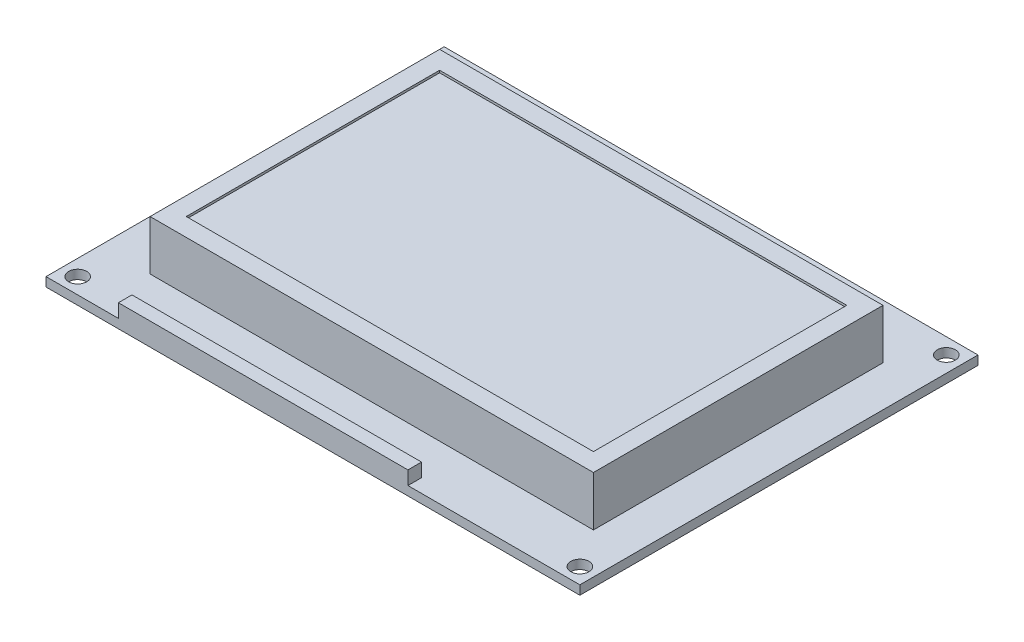
ISO-10303-21;
HEADER;
FILE_DESCRIPTION(('STEP AP214'),'2;1');
FILE_NAME('part.step','',(''),(''),'','','');
FILE_SCHEMA(('AUTOMOTIVE_DESIGN { 1 0 10303 214 1 1 1 1 }'));
ENDSEC;
DATA;
#1=APPLICATION_CONTEXT('core data for automotive mechanical design processes');
#2=APPLICATION_PROTOCOL_DEFINITION('international standard','automotive_design',2000,#1);
#3=PRODUCT_CONTEXT('',#1,'mechanical');
#4=PRODUCT('Part','Part','',(#3));
#5=PRODUCT_RELATED_PRODUCT_CATEGORY('part','',(#4));
#6=PRODUCT_DEFINITION_FORMATION('','',#4);
#7=PRODUCT_DEFINITION_CONTEXT('part definition',#1,'design');
#8=PRODUCT_DEFINITION('design','',#6,#7);
#9=PRODUCT_DEFINITION_SHAPE('','',#8);
#10=(LENGTH_UNIT() NAMED_UNIT(*) SI_UNIT(.MILLI.,.METRE.));
#11=(NAMED_UNIT(*) PLANE_ANGLE_UNIT() SI_UNIT($,.RADIAN.));
#12=(NAMED_UNIT(*) SI_UNIT($,.STERADIAN.) SOLID_ANGLE_UNIT());
#13=UNCERTAINTY_MEASURE_WITH_UNIT(LENGTH_MEASURE(1.E-05),#10,'distance_accuracy_value','');
#14=(GEOMETRIC_REPRESENTATION_CONTEXT(3) GLOBAL_UNCERTAINTY_ASSIGNED_CONTEXT((#13)) GLOBAL_UNIT_ASSIGNED_CONTEXT((#10,
#11,#12)) REPRESENTATION_CONTEXT('',''));
#15=CARTESIAN_POINT('',(0.,0.,0.));
#16=DIRECTION('',(0.,0.,1.));
#17=DIRECTION('',(1.,0.,0.));
#18=AXIS2_PLACEMENT_3D('',#15,#16,#17);
#19=CARTESIAN_POINT('',(0.,1.5875,0.));
#20=DIRECTION('',(0.,-1.,0.));
#21=DIRECTION('',(0.,0.,-1.));
#22=AXIS2_PLACEMENT_3D('',#19,#20,#21);
#23=PLANE('',#22);
#24=DIRECTION('',(0.,0.,1.));
#25=VECTOR('',#24,1.);
#26=CARTESIAN_POINT('',(8.73125,1.5875,-9.525));
#27=LINE('',#26,#25);
#28=CARTESIAN_POINT('',(8.73125,1.5875,-60.325));
#29=VERTEX_POINT('',#28);
#30=CARTESIAN_POINT('',(8.73125,1.5875,-9.525));
#31=VERTEX_POINT('',#30);
#32=EDGE_CURVE('E212',#29,#31,#27,.T.);
#33=ORIENTED_EDGE('',*,*,#32,.F.);
#34=DIRECTION('',(-1.,0.,0.));
#35=VECTOR('',#34,1.);
#36=CARTESIAN_POINT('',(8.73125,1.5875,-60.325));
#37=LINE('',#36,#35);
#38=CARTESIAN_POINT('',(86.51875,1.5875,-60.325));
#39=VERTEX_POINT('',#38);
#40=EDGE_CURVE('E217',#39,#29,#37,.T.);
#41=ORIENTED_EDGE('',*,*,#40,.F.);
#42=DIRECTION('',(0.,0.,-1.));
#43=VECTOR('',#42,1.);
#44=CARTESIAN_POINT('',(86.51875,1.5875,-9.525));
#45=LINE('',#44,#43);
#46=CARTESIAN_POINT('',(86.51875,1.5875,-9.525));
#47=VERTEX_POINT('',#46);
#48=EDGE_CURVE('E229',#47,#39,#45,.T.);
#49=ORIENTED_EDGE('',*,*,#48,.F.);
#50=DIRECTION('',(1.,0.,0.));
#51=VECTOR('',#50,1.);
#52=CARTESIAN_POINT('',(8.73125,1.5875,-9.525));
#53=LINE('',#52,#51);
#54=EDGE_CURVE('E226',#31,#47,#53,.T.);
#55=ORIENTED_EDGE('',*,*,#54,.F.);
#56=EDGE_LOOP('',(#33,#41,#49,#55));
#57=FACE_BOUND('',#56,.T.);
#58=CARTESIAN_POINT('',(2.77812499999999,1.5875,-67.071875));
#59=DIRECTION('',(0.,1.,0.));
#60=DIRECTION('',(0.,0.,1.));
#61=AXIS2_PLACEMENT_3D('',#58,#59,#60);
#62=CIRCLE('',#61,1.5875);
#63=CARTESIAN_POINT('',(2.77812499999999,1.5875,-65.484375));
#64=VERTEX_POINT('',#63);
#65=EDGE_CURVE('E264',#64,#64,#62,.T.);
#66=ORIENTED_EDGE('',*,*,#65,.F.);
#67=EDGE_LOOP('',(#66));
#68=FACE_BOUND('',#67,.T.);
#69=CARTESIAN_POINT('',(90.884375,1.5875,-67.071875));
#70=DIRECTION('',(0.,1.,0.));
#71=DIRECTION('',(0.,0.,1.));
#72=AXIS2_PLACEMENT_3D('',#69,#70,#71);
#73=CIRCLE('',#72,1.5875);
#74=CARTESIAN_POINT('',(90.884375,1.5875,-65.484375));
#75=VERTEX_POINT('',#74);
#76=EDGE_CURVE('E258',#75,#75,#73,.T.);
#77=ORIENTED_EDGE('',*,*,#76,.F.);
#78=EDGE_LOOP('',(#77));
#79=FACE_BOUND('',#78,.T.);
#80=CARTESIAN_POINT('',(2.778125,1.5875,-2.778125));
#81=DIRECTION('',(0.,1.,0.));
#82=DIRECTION('',(0.,0.,1.));
#83=AXIS2_PLACEMENT_3D('',#80,#81,#82);
#84=CIRCLE('',#83,1.5875);
#85=CARTESIAN_POINT('',(2.778125,1.5875,-1.190625));
#86=VERTEX_POINT('',#85);
#87=EDGE_CURVE('E252',#86,#86,#84,.T.);
#88=ORIENTED_EDGE('',*,*,#87,.F.);
#89=EDGE_LOOP('',(#88));
#90=FACE_BOUND('',#89,.T.);
#91=CARTESIAN_POINT('',(90.884375,1.5875,-2.778125));
#92=DIRECTION('',(0.,1.,0.));
#93=DIRECTION('',(0.,0.,1.));
#94=AXIS2_PLACEMENT_3D('',#91,#92,#93);
#95=CIRCLE('',#94,1.5875);
#96=CARTESIAN_POINT('',(90.884375,1.5875,-1.190625));
#97=VERTEX_POINT('',#96);
#98=EDGE_CURVE('E246',#97,#97,#95,.T.);
#99=ORIENTED_EDGE('',*,*,#98,.F.);
#100=EDGE_LOOP('',(#99));
#101=FACE_BOUND('',#100,.T.);
#102=DIRECTION('',(0.,0.,1.));
#103=VECTOR('',#102,1.);
#104=CARTESIAN_POINT('',(12.7,1.5875,0.));
#105=LINE('',#104,#103);
#106=CARTESIAN_POINT('',(12.7,1.5875,-2.38125));
#107=VERTEX_POINT('',#106);
#108=CARTESIAN_POINT('',(12.7,1.5875,0.));
#109=VERTEX_POINT('',#108);
#110=EDGE_CURVE('E57',#107,#109,#105,.T.);
#111=ORIENTED_EDGE('',*,*,#110,.F.);
#112=DIRECTION('',(-1.,0.,0.));
#113=VECTOR('',#112,1.);
#114=CARTESIAN_POINT('',(12.7,1.5875,-2.38125));
#115=LINE('',#114,#113);
#116=CARTESIAN_POINT('',(63.5,1.5875,-2.38125));
#117=VERTEX_POINT('',#116);
#118=EDGE_CURVE('E189',#117,#107,#115,.T.);
#119=ORIENTED_EDGE('',*,*,#118,.F.);
#120=DIRECTION('',(0.,0.,-1.));
#121=VECTOR('',#120,1.);
#122=CARTESIAN_POINT('',(63.5,1.5875,0.));
#123=LINE('',#122,#121);
#124=CARTESIAN_POINT('',(63.5,1.5875,0.));
#125=VERTEX_POINT('',#124);
#126=EDGE_CURVE('E197',#125,#117,#123,.T.);
#127=ORIENTED_EDGE('',*,*,#126,.F.);
#128=DIRECTION('',(1.,0.,0.));
#129=VECTOR('',#128,1.);
#130=CARTESIAN_POINT('',(0.,1.5875,0.));
#131=LINE('',#130,#129);
#132=CARTESIAN_POINT('',(93.6625,1.5875,0.));
#133=VERTEX_POINT('',#132);
#134=EDGE_CURVE('E273',#125,#133,#131,.T.);
#135=ORIENTED_EDGE('',*,*,#134,.T.);
#136=DIRECTION('',(0.,0.,-1.));
#137=VECTOR('',#136,1.);
#138=CARTESIAN_POINT('',(93.6625,1.5875,0.));
#139=LINE('',#138,#137);
#140=CARTESIAN_POINT('',(93.6625,1.5875,-69.85));
#141=VERTEX_POINT('',#140);
#142=EDGE_CURVE('E277',#133,#141,#139,.T.);
#143=ORIENTED_EDGE('',*,*,#142,.T.);
#144=DIRECTION('',(-1.,0.,0.));
#145=VECTOR('',#144,1.);
#146=CARTESIAN_POINT('',(0.,1.5875,-69.85));
#147=LINE('',#146,#145);
#148=CARTESIAN_POINT('',(0.,1.5875,-69.85));
#149=VERTEX_POINT('',#148);
#150=EDGE_CURVE('E279',#141,#149,#147,.T.);
#151=ORIENTED_EDGE('',*,*,#150,.T.);
#152=DIRECTION('',(0.,0.,1.));
#153=VECTOR('',#152,1.);
#154=CARTESIAN_POINT('',(0.,1.5875,0.));
#155=LINE('',#154,#153);
#156=CARTESIAN_POINT('',(0.,1.5875,0.));
#157=VERTEX_POINT('',#156);
#158=EDGE_CURVE('E270',#149,#157,#155,.T.);
#159=ORIENTED_EDGE('',*,*,#158,.T.);
#160=EDGE_CURVE('E275',#157,#109,#131,.T.);
#161=ORIENTED_EDGE('',*,*,#160,.T.);
#162=EDGE_LOOP('',(#111,#119,#127,#135,#143,#151,#159,#161));
#163=FACE_BOUND('',#162,.T.);
#164=ADVANCED_FACE('F34',(#57,#68,#79,#90,#101,#163),#23,.F.);
#165=CARTESIAN_POINT('',(0.,0.,0.));
#166=DIRECTION('',(0.,-1.,0.));
#167=DIRECTION('',(0.,0.,-1.));
#168=AXIS2_PLACEMENT_3D('',#165,#166,#167);
#169=PLANE('',#168);
#170=CARTESIAN_POINT('',(2.778125,0.,-2.778125));
#171=DIRECTION('',(0.,1.,0.));
#172=DIRECTION('',(0.,0.,1.));
#173=AXIS2_PLACEMENT_3D('',#170,#171,#172);
#174=CIRCLE('',#173,1.5875);
#175=CARTESIAN_POINT('',(2.778125,0.,-1.190625));
#176=VERTEX_POINT('',#175);
#177=EDGE_CURVE('E249',#176,#176,#174,.T.);
#178=ORIENTED_EDGE('',*,*,#177,.T.);
#179=EDGE_LOOP('',(#178));
#180=FACE_BOUND('',#179,.T.);
#181=CARTESIAN_POINT('',(2.77812499999999,0.,-67.071875));
#182=DIRECTION('',(0.,1.,0.));
#183=DIRECTION('',(0.,0.,1.));
#184=AXIS2_PLACEMENT_3D('',#181,#182,#183);
#185=CIRCLE('',#184,1.5875);
#186=CARTESIAN_POINT('',(2.77812499999999,0.,-65.484375));
#187=VERTEX_POINT('',#186);
#188=EDGE_CURVE('E261',#187,#187,#185,.T.);
#189=ORIENTED_EDGE('',*,*,#188,.T.);
#190=EDGE_LOOP('',(#189));
#191=FACE_BOUND('',#190,.T.);
#192=DIRECTION('',(0.,0.,1.));
#193=VECTOR('',#192,1.);
#194=CARTESIAN_POINT('',(0.,0.,0.));
#195=LINE('',#194,#193);
#196=CARTESIAN_POINT('',(0.,0.,-69.85));
#197=VERTEX_POINT('',#196);
#198=CARTESIAN_POINT('',(0.,0.,0.));
#199=VERTEX_POINT('',#198);
#200=EDGE_CURVE('E267',#197,#199,#195,.T.);
#201=ORIENTED_EDGE('',*,*,#200,.F.);
#202=DIRECTION('',(-1.,0.,0.));
#203=VECTOR('',#202,1.);
#204=CARTESIAN_POINT('',(0.,0.,-69.85));
#205=LINE('',#204,#203);
#206=CARTESIAN_POINT('',(93.6625,0.,-69.85));
#207=VERTEX_POINT('',#206);
#208=EDGE_CURVE('E274',#207,#197,#205,.T.);
#209=ORIENTED_EDGE('',*,*,#208,.F.);
#210=DIRECTION('',(0.,0.,-1.));
#211=VECTOR('',#210,1.);
#212=CARTESIAN_POINT('',(93.6625,0.,0.));
#213=LINE('',#212,#211);
#214=CARTESIAN_POINT('',(93.6625,0.,0.));
#215=VERTEX_POINT('',#214);
#216=EDGE_CURVE('E286',#215,#207,#213,.T.);
#217=ORIENTED_EDGE('',*,*,#216,.F.);
#218=DIRECTION('',(1.,0.,0.));
#219=VECTOR('',#218,1.);
#220=CARTESIAN_POINT('',(0.,0.,0.));
#221=LINE('',#220,#219);
#222=EDGE_CURVE('E284',#199,#215,#221,.T.);
#223=ORIENTED_EDGE('',*,*,#222,.F.);
#224=EDGE_LOOP('',(#201,#209,#217,#223));
#225=FACE_BOUND('',#224,.T.);
#226=CARTESIAN_POINT('',(90.884375,0.,-67.071875));
#227=DIRECTION('',(0.,1.,0.));
#228=DIRECTION('',(0.,0.,1.));
#229=AXIS2_PLACEMENT_3D('',#226,#227,#228);
#230=CIRCLE('',#229,1.5875);
#231=CARTESIAN_POINT('',(90.884375,0.,-65.484375));
#232=VERTEX_POINT('',#231);
#233=EDGE_CURVE('E255',#232,#232,#230,.T.);
#234=ORIENTED_EDGE('',*,*,#233,.T.);
#235=EDGE_LOOP('',(#234));
#236=FACE_BOUND('',#235,.T.);
#237=CARTESIAN_POINT('',(90.884375,0.,-2.778125));
#238=DIRECTION('',(0.,1.,0.));
#239=DIRECTION('',(0.,0.,1.));
#240=AXIS2_PLACEMENT_3D('',#237,#238,#239);
#241=CIRCLE('',#240,1.5875);
#242=CARTESIAN_POINT('',(90.884375,0.,-1.190625));
#243=VERTEX_POINT('',#242);
#244=EDGE_CURVE('E245',#243,#243,#241,.T.);
#245=ORIENTED_EDGE('',*,*,#244,.T.);
#246=EDGE_LOOP('',(#245));
#247=FACE_BOUND('',#246,.T.);
#248=ADVANCED_FACE('F304',(#180,#191,#225,#236,#247),#169,.T.);
#249=CARTESIAN_POINT('',(0.,1.5875,0.));
#250=DIRECTION('',(1.,0.,0.));
#251=DIRECTION('',(0.,0.,-1.));
#252=AXIS2_PLACEMENT_3D('',#249,#250,#251);
#253=PLANE('',#252);
#254=ORIENTED_EDGE('',*,*,#200,.T.);
#255=DIRECTION('',(0.,-1.,0.));
#256=VECTOR('',#255,1.);
#257=CARTESIAN_POINT('',(0.,1.5875,0.));
#258=LINE('',#257,#256);
#259=EDGE_CURVE('E11',#157,#199,#258,.T.);
#260=ORIENTED_EDGE('',*,*,#259,.F.);
#261=ORIENTED_EDGE('',*,*,#158,.F.);
#262=DIRECTION('',(0.,-1.,0.));
#263=VECTOR('',#262,1.);
#264=CARTESIAN_POINT('',(0.,1.5875,-69.85));
#265=LINE('',#264,#263);
#266=EDGE_CURVE('E281',#149,#197,#265,.T.);
#267=ORIENTED_EDGE('',*,*,#266,.T.);
#268=EDGE_LOOP('',(#254,#260,#261,#267));
#269=FACE_BOUND('',#268,.T.);
#270=ADVANCED_FACE('F36',(#269),#253,.F.);
#271=CARTESIAN_POINT('',(0.,1.5875,0.));
#272=DIRECTION('',(0.,0.,-1.));
#273=DIRECTION('',(-1.,0.,0.));
#274=AXIS2_PLACEMENT_3D('',#271,#272,#273);
#275=PLANE('',#274);
#276=ORIENTED_EDGE('',*,*,#222,.T.);
#277=DIRECTION('',(0.,-1.,0.));
#278=VECTOR('',#277,1.);
#279=CARTESIAN_POINT('',(93.6625,1.5875,0.));
#280=LINE('',#279,#278);
#281=EDGE_CURVE('E42',#133,#215,#280,.T.);
#282=ORIENTED_EDGE('',*,*,#281,.F.);
#283=ORIENTED_EDGE('',*,*,#134,.F.);
#284=DIRECTION('',(0.,-1.,0.));
#285=VECTOR('',#284,1.);
#286=CARTESIAN_POINT('',(63.5,3.96875,0.));
#287=LINE('',#286,#285);
#288=CARTESIAN_POINT('',(63.5,3.96875,0.));
#289=VERTEX_POINT('',#288);
#290=EDGE_CURVE('E206',#289,#125,#287,.T.);
#291=ORIENTED_EDGE('',*,*,#290,.F.);
#292=DIRECTION('',(1.,0.,0.));
#293=VECTOR('',#292,1.);
#294=CARTESIAN_POINT('',(12.7,3.96875,0.));
#295=LINE('',#294,#293);
#296=CARTESIAN_POINT('',(12.7,3.96875,0.));
#297=VERTEX_POINT('',#296);
#298=EDGE_CURVE('E188',#297,#289,#295,.T.);
#299=ORIENTED_EDGE('',*,*,#298,.F.);
#300=DIRECTION('',(0.,-1.,0.));
#301=VECTOR('',#300,1.);
#302=CARTESIAN_POINT('',(12.7,3.96875,0.));
#303=LINE('',#302,#301);
#304=EDGE_CURVE('E209',#297,#109,#303,.T.);
#305=ORIENTED_EDGE('',*,*,#304,.T.);
#306=ORIENTED_EDGE('',*,*,#160,.F.);
#307=ORIENTED_EDGE('',*,*,#259,.T.);
#308=EDGE_LOOP('',(#276,#282,#283,#291,#299,#305,#306,#307));
#309=FACE_BOUND('',#308,.T.);
#310=ADVANCED_FACE('F315',(#309),#275,.F.);
#311=CARTESIAN_POINT('',(93.6625,1.5875,0.));
#312=DIRECTION('',(-1.,0.,0.));
#313=DIRECTION('',(0.,0.,1.));
#314=AXIS2_PLACEMENT_3D('',#311,#312,#313);
#315=PLANE('',#314);
#316=ORIENTED_EDGE('',*,*,#216,.T.);
#317=DIRECTION('',(0.,-1.,0.));
#318=VECTOR('',#317,1.);
#319=CARTESIAN_POINT('',(93.6625,1.5875,-69.85));
#320=LINE('',#319,#318);
#321=EDGE_CURVE('E291',#141,#207,#320,.T.);
#322=ORIENTED_EDGE('',*,*,#321,.F.);
#323=ORIENTED_EDGE('',*,*,#142,.F.);
#324=ORIENTED_EDGE('',*,*,#281,.T.);
#325=EDGE_LOOP('',(#316,#322,#323,#324));
#326=FACE_BOUND('',#325,.T.);
#327=ADVANCED_FACE('F298',(#326),#315,.F.);
#328=CARTESIAN_POINT('',(0.,1.5875,-69.85));
#329=DIRECTION('',(0.,0.,1.));
#330=DIRECTION('',(1.,0.,0.));
#331=AXIS2_PLACEMENT_3D('',#328,#329,#330);
#332=PLANE('',#331);
#333=ORIENTED_EDGE('',*,*,#208,.T.);
#334=ORIENTED_EDGE('',*,*,#266,.F.);
#335=ORIENTED_EDGE('',*,*,#150,.F.);
#336=ORIENTED_EDGE('',*,*,#321,.T.);
#337=EDGE_LOOP('',(#333,#334,#335,#336));
#338=FACE_BOUND('',#337,.T.);
#339=ADVANCED_FACE('F308',(#338),#332,.F.);
#340=CARTESIAN_POINT('',(2.77812499999999,1.5875,-67.071875));
#341=DIRECTION('',(0.,-1.,0.));
#342=DIRECTION('',(0.,0.,-1.));
#343=AXIS2_PLACEMENT_3D('',#340,#341,#342);
#344=CYLINDRICAL_SURFACE('',#343,1.5875);
#345=ORIENTED_EDGE('',*,*,#65,.T.);
#346=EDGE_LOOP('',(#345));
#347=FACE_BOUND('',#346,.T.);
#348=ORIENTED_EDGE('',*,*,#188,.F.);
#349=EDGE_LOOP('',(#348));
#350=FACE_BOUND('',#349,.T.);
#351=ADVANCED_FACE('F348',(#347,#350),#344,.F.);
#352=CARTESIAN_POINT('',(90.884375,1.5875,-67.071875));
#353=DIRECTION('',(0.,-1.,0.));
#354=DIRECTION('',(0.,0.,-1.));
#355=AXIS2_PLACEMENT_3D('',#352,#353,#354);
#356=CYLINDRICAL_SURFACE('',#355,1.5875);
#357=ORIENTED_EDGE('',*,*,#76,.T.);
#358=EDGE_LOOP('',(#357));
#359=FACE_BOUND('',#358,.T.);
#360=ORIENTED_EDGE('',*,*,#233,.F.);
#361=EDGE_LOOP('',(#360));
#362=FACE_BOUND('',#361,.T.);
#363=ADVANCED_FACE('F394',(#359,#362),#356,.F.);
#364=CARTESIAN_POINT('',(2.778125,1.5875,-2.778125));
#365=DIRECTION('',(0.,-1.,0.));
#366=DIRECTION('',(0.,0.,-1.));
#367=AXIS2_PLACEMENT_3D('',#364,#365,#366);
#368=CYLINDRICAL_SURFACE('',#367,1.5875);
#369=ORIENTED_EDGE('',*,*,#87,.T.);
#370=EDGE_LOOP('',(#369));
#371=FACE_BOUND('',#370,.T.);
#372=ORIENTED_EDGE('',*,*,#177,.F.);
#373=EDGE_LOOP('',(#372));
#374=FACE_BOUND('',#373,.T.);
#375=ADVANCED_FACE('F402',(#371,#374),#368,.F.);
#376=CARTESIAN_POINT('',(90.884375,1.5875,-2.778125));
#377=DIRECTION('',(0.,-1.,0.));
#378=DIRECTION('',(0.,0.,-1.));
#379=AXIS2_PLACEMENT_3D('',#376,#377,#378);
#380=CYLINDRICAL_SURFACE('',#379,1.5875);
#381=ORIENTED_EDGE('',*,*,#98,.T.);
#382=EDGE_LOOP('',(#381));
#383=FACE_BOUND('',#382,.T.);
#384=ORIENTED_EDGE('',*,*,#244,.F.);
#385=EDGE_LOOP('',(#384));
#386=FACE_BOUND('',#385,.T.);
#387=ADVANCED_FACE('F410',(#383,#386),#380,.F.);
#388=CARTESIAN_POINT('',(8.73125,10.31875,-9.525));
#389=DIRECTION('',(1.,0.,0.));
#390=DIRECTION('',(0.,0.,-1.));
#391=AXIS2_PLACEMENT_3D('',#388,#389,#390);
#392=PLANE('',#391);
#393=ORIENTED_EDGE('',*,*,#32,.T.);
#394=DIRECTION('',(0.,-1.,0.));
#395=VECTOR('',#394,1.);
#396=CARTESIAN_POINT('',(8.73125,10.31875,-9.525));
#397=LINE('',#396,#395);
#398=CARTESIAN_POINT('',(8.73125,10.31875,-9.525));
#399=VERTEX_POINT('',#398);
#400=EDGE_CURVE('E242',#399,#31,#397,.T.);
#401=ORIENTED_EDGE('',*,*,#400,.F.);
#402=DIRECTION('',(0.,0.,1.));
#403=VECTOR('',#402,1.);
#404=CARTESIAN_POINT('',(8.73125,10.31875,-9.525));
#405=LINE('',#404,#403);
#406=CARTESIAN_POINT('',(8.73125,10.31875,-60.325));
#407=VERTEX_POINT('',#406);
#408=EDGE_CURVE('E213',#407,#399,#405,.T.);
#409=ORIENTED_EDGE('',*,*,#408,.F.);
#410=DIRECTION('',(0.,-1.,0.));
#411=VECTOR('',#410,1.);
#412=CARTESIAN_POINT('',(8.73125,10.31875,-60.325));
#413=LINE('',#412,#411);
#414=EDGE_CURVE('E223',#407,#29,#413,.T.);
#415=ORIENTED_EDGE('',*,*,#414,.T.);
#416=EDGE_LOOP('',(#393,#401,#409,#415));
#417=FACE_BOUND('',#416,.T.);
#418=ADVANCED_FACE('F419',(#417),#392,.F.);
#419=CARTESIAN_POINT('',(8.73125,10.31875,-9.525));
#420=DIRECTION('',(0.,0.,-1.));
#421=DIRECTION('',(-1.,0.,0.));
#422=AXIS2_PLACEMENT_3D('',#419,#420,#421);
#423=PLANE('',#422);
#424=ORIENTED_EDGE('',*,*,#54,.T.);
#425=DIRECTION('',(0.,-1.,0.));
#426=VECTOR('',#425,1.);
#427=CARTESIAN_POINT('',(86.51875,10.31875,-9.525));
#428=LINE('',#427,#426);
#429=CARTESIAN_POINT('',(86.51875,10.31875,-9.525));
#430=VERTEX_POINT('',#429);
#431=EDGE_CURVE('E239',#430,#47,#428,.T.);
#432=ORIENTED_EDGE('',*,*,#431,.F.);
#433=DIRECTION('',(1.,0.,0.));
#434=VECTOR('',#433,1.);
#435=CARTESIAN_POINT('',(8.73125,10.31875,-9.525));
#436=LINE('',#435,#434);
#437=EDGE_CURVE('E216',#399,#430,#436,.T.);
#438=ORIENTED_EDGE('',*,*,#437,.F.);
#439=ORIENTED_EDGE('',*,*,#400,.T.);
#440=EDGE_LOOP('',(#424,#432,#438,#439));
#441=FACE_BOUND('',#440,.T.);
#442=ADVANCED_FACE('F428',(#441),#423,.F.);
#443=CARTESIAN_POINT('',(86.51875,10.31875,-9.525));
#444=DIRECTION('',(-1.,0.,0.));
#445=DIRECTION('',(0.,0.,1.));
#446=AXIS2_PLACEMENT_3D('',#443,#444,#445);
#447=PLANE('',#446);
#448=ORIENTED_EDGE('',*,*,#48,.T.);
#449=DIRECTION('',(0.,-1.,0.));
#450=VECTOR('',#449,1.);
#451=CARTESIAN_POINT('',(86.51875,10.31875,-60.325));
#452=LINE('',#451,#450);
#453=CARTESIAN_POINT('',(86.51875,10.31875,-60.325));
#454=VERTEX_POINT('',#453);
#455=EDGE_CURVE('E236',#454,#39,#452,.T.);
#456=ORIENTED_EDGE('',*,*,#455,.F.);
#457=DIRECTION('',(0.,0.,-1.));
#458=VECTOR('',#457,1.);
#459=CARTESIAN_POINT('',(86.51875,10.31875,-9.525));
#460=LINE('',#459,#458);
#461=EDGE_CURVE('E219',#430,#454,#460,.T.);
#462=ORIENTED_EDGE('',*,*,#461,.F.);
#463=ORIENTED_EDGE('',*,*,#431,.T.);
#464=EDGE_LOOP('',(#448,#456,#462,#463));
#465=FACE_BOUND('',#464,.T.);
#466=ADVANCED_FACE('F437',(#465),#447,.F.);
#467=CARTESIAN_POINT('',(8.73125,10.31875,-60.325));
#468=DIRECTION('',(0.,0.,1.));
#469=DIRECTION('',(1.,0.,0.));
#470=AXIS2_PLACEMENT_3D('',#467,#468,#469);
#471=PLANE('',#470);
#472=ORIENTED_EDGE('',*,*,#40,.T.);
#473=ORIENTED_EDGE('',*,*,#414,.F.);
#474=DIRECTION('',(-1.,0.,0.));
#475=VECTOR('',#474,1.);
#476=CARTESIAN_POINT('',(8.73125,10.31875,-60.325));
#477=LINE('',#476,#475);
#478=EDGE_CURVE('E221',#454,#407,#477,.T.);
#479=ORIENTED_EDGE('',*,*,#478,.F.);
#480=ORIENTED_EDGE('',*,*,#455,.T.);
#481=EDGE_LOOP('',(#472,#473,#479,#480));
#482=FACE_BOUND('',#481,.T.);
#483=ADVANCED_FACE('F446',(#482),#471,.F.);
#484=CARTESIAN_POINT('',(0.,10.31875,0.));
#485=DIRECTION('',(0.,-1.,0.));
#486=DIRECTION('',(0.,0.,-1.));
#487=AXIS2_PLACEMENT_3D('',#484,#485,#486);
#488=PLANE('',#487);
#489=DIRECTION('',(1.,0.,0.));
#490=VECTOR('',#489,1.);
#491=CARTESIAN_POINT('',(11.90625,10.31875,-12.7));
#492=LINE('',#491,#490);
#493=CARTESIAN_POINT('',(11.90625,10.31875,-12.7));
#494=VERTEX_POINT('',#493);
#495=CARTESIAN_POINT('',(83.34375,10.31875,-12.7));
#496=VERTEX_POINT('',#495);
#497=EDGE_CURVE('E176',#494,#496,#492,.T.);
#498=ORIENTED_EDGE('',*,*,#497,.F.);
#499=DIRECTION('',(0.,0.,1.));
#500=VECTOR('',#499,1.);
#501=CARTESIAN_POINT('',(11.90625,10.31875,-57.15));
#502=LINE('',#501,#500);
#503=CARTESIAN_POINT('',(11.90625,10.31875,-57.15));
#504=VERTEX_POINT('',#503);
#505=EDGE_CURVE('E49',#504,#494,#502,.T.);
#506=ORIENTED_EDGE('',*,*,#505,.F.);
#507=DIRECTION('',(-1.,0.,0.));
#508=VECTOR('',#507,1.);
#509=CARTESIAN_POINT('',(11.90625,10.31875,-57.15));
#510=LINE('',#509,#508);
#511=CARTESIAN_POINT('',(83.34375,10.31875,-57.15));
#512=VERTEX_POINT('',#511);
#513=EDGE_CURVE('E167',#512,#504,#510,.T.);
#514=ORIENTED_EDGE('',*,*,#513,.F.);
#515=DIRECTION('',(0.,0.,-1.));
#516=VECTOR('',#515,1.);
#517=CARTESIAN_POINT('',(83.34375,10.31875,-57.15));
#518=LINE('',#517,#516);
#519=EDGE_CURVE('E170',#496,#512,#518,.T.);
#520=ORIENTED_EDGE('',*,*,#519,.F.);
#521=EDGE_LOOP('',(#498,#506,#514,#520));
#522=FACE_BOUND('',#521,.T.);
#523=ORIENTED_EDGE('',*,*,#408,.T.);
#524=ORIENTED_EDGE('',*,*,#437,.T.);
#525=ORIENTED_EDGE('',*,*,#461,.T.);
#526=ORIENTED_EDGE('',*,*,#478,.T.);
#527=EDGE_LOOP('',(#523,#524,#525,#526));
#528=FACE_BOUND('',#527,.T.);
#529=ADVANCED_FACE('F455',(#522,#528),#488,.F.);
#530=CARTESIAN_POINT('',(12.7,3.96875,0.));
#531=DIRECTION('',(1.,0.,0.));
#532=DIRECTION('',(0.,0.,-1.));
#533=AXIS2_PLACEMENT_3D('',#530,#531,#532);
#534=PLANE('',#533);
#535=ORIENTED_EDGE('',*,*,#110,.T.);
#536=ORIENTED_EDGE('',*,*,#304,.F.);
#537=DIRECTION('',(0.,0.,1.));
#538=VECTOR('',#537,1.);
#539=CARTESIAN_POINT('',(12.7,3.96875,0.));
#540=LINE('',#539,#538);
#541=CARTESIAN_POINT('',(12.7,3.96875,-2.38125));
#542=VERTEX_POINT('',#541);
#543=EDGE_CURVE('E185',#542,#297,#540,.T.);
#544=ORIENTED_EDGE('',*,*,#543,.F.);
#545=DIRECTION('',(0.,-1.,0.));
#546=VECTOR('',#545,1.);
#547=CARTESIAN_POINT('',(12.7,3.96875,-2.38125));
#548=LINE('',#547,#546);
#549=EDGE_CURVE('E195',#542,#107,#548,.T.);
#550=ORIENTED_EDGE('',*,*,#549,.T.);
#551=EDGE_LOOP('',(#535,#536,#544,#550));
#552=FACE_BOUND('',#551,.T.);
#553=ADVANCED_FACE('F327',(#552),#534,.F.);
#554=CARTESIAN_POINT('',(63.5,3.96875,0.));
#555=DIRECTION('',(-1.,0.,0.));
#556=DIRECTION('',(0.,0.,1.));
#557=AXIS2_PLACEMENT_3D('',#554,#555,#556);
#558=PLANE('',#557);
#559=ORIENTED_EDGE('',*,*,#126,.T.);
#560=DIRECTION('',(0.,-1.,0.));
#561=VECTOR('',#560,1.);
#562=CARTESIAN_POINT('',(63.5,3.96875,-2.38125));
#563=LINE('',#562,#561);
#564=CARTESIAN_POINT('',(63.5,3.96875,-2.38125));
#565=VERTEX_POINT('',#564);
#566=EDGE_CURVE('E203',#565,#117,#563,.T.);
#567=ORIENTED_EDGE('',*,*,#566,.F.);
#568=DIRECTION('',(0.,0.,-1.));
#569=VECTOR('',#568,1.);
#570=CARTESIAN_POINT('',(63.5,3.96875,0.));
#571=LINE('',#570,#569);
#572=EDGE_CURVE('E191',#289,#565,#571,.T.);
#573=ORIENTED_EDGE('',*,*,#572,.F.);
#574=ORIENTED_EDGE('',*,*,#290,.T.);
#575=EDGE_LOOP('',(#559,#567,#573,#574));
#576=FACE_BOUND('',#575,.T.);
#577=ADVANCED_FACE('F319',(#576),#558,.F.);
#578=CARTESIAN_POINT('',(12.7,3.96875,-2.38125));
#579=DIRECTION('',(0.,0.,1.));
#580=DIRECTION('',(1.,0.,0.));
#581=AXIS2_PLACEMENT_3D('',#578,#579,#580);
#582=PLANE('',#581);
#583=ORIENTED_EDGE('',*,*,#118,.T.);
#584=ORIENTED_EDGE('',*,*,#549,.F.);
#585=DIRECTION('',(-1.,0.,0.));
#586=VECTOR('',#585,1.);
#587=CARTESIAN_POINT('',(12.7,3.96875,-2.38125));
#588=LINE('',#587,#586);
#589=EDGE_CURVE('E193',#565,#542,#588,.T.);
#590=ORIENTED_EDGE('',*,*,#589,.F.);
#591=ORIENTED_EDGE('',*,*,#566,.T.);
#592=EDGE_LOOP('',(#583,#584,#590,#591));
#593=FACE_BOUND('',#592,.T.);
#594=ADVANCED_FACE('F329',(#593),#582,.F.);
#595=CARTESIAN_POINT('',(0.,3.96875,0.));
#596=DIRECTION('',(0.,-1.,0.));
#597=DIRECTION('',(0.,0.,-1.));
#598=AXIS2_PLACEMENT_3D('',#595,#596,#597);
#599=PLANE('',#598);
#600=ORIENTED_EDGE('',*,*,#543,.T.);
#601=ORIENTED_EDGE('',*,*,#298,.T.);
#602=ORIENTED_EDGE('',*,*,#572,.T.);
#603=ORIENTED_EDGE('',*,*,#589,.T.);
#604=EDGE_LOOP('',(#600,#601,#602,#603));
#605=FACE_BOUND('',#604,.T.);
#606=ADVANCED_FACE('F322',(#605),#599,.F.);
#607=CARTESIAN_POINT('',(11.90625,9.921875,-57.15));
#608=DIRECTION('',(-1.,0.,0.));
#609=DIRECTION('',(0.,0.,1.));
#610=AXIS2_PLACEMENT_3D('',#607,#608,#609);
#611=PLANE('',#610);
#612=ORIENTED_EDGE('',*,*,#505,.T.);
#613=DIRECTION('',(0.,1.,0.));
#614=VECTOR('',#613,1.);
#615=CARTESIAN_POINT('',(11.90625,9.921875,-12.7));
#616=LINE('',#615,#614);
#617=CARTESIAN_POINT('',(11.90625,9.921875,-12.7));
#618=VERTEX_POINT('',#617);
#619=EDGE_CURVE('E145',#618,#494,#616,.T.);
#620=ORIENTED_EDGE('',*,*,#619,.F.);
#621=DIRECTION('',(0.,0.,1.));
#622=VECTOR('',#621,1.);
#623=CARTESIAN_POINT('',(11.90625,9.921875,-57.15));
#624=LINE('',#623,#622);
#625=CARTESIAN_POINT('',(11.90625,9.921875,-57.15));
#626=VERTEX_POINT('',#625);
#627=EDGE_CURVE('E149',#626,#618,#624,.T.);
#628=ORIENTED_EDGE('',*,*,#627,.F.);
#629=DIRECTION('',(0.,1.,0.));
#630=VECTOR('',#629,1.);
#631=CARTESIAN_POINT('',(11.90625,9.921875,-57.15));
#632=LINE('',#631,#630);
#633=EDGE_CURVE('E180',#626,#504,#632,.T.);
#634=ORIENTED_EDGE('',*,*,#633,.T.);
#635=EDGE_LOOP('',(#612,#620,#628,#634));
#636=FACE_BOUND('',#635,.T.);
#637=ADVANCED_FACE('F147',(#636),#611,.F.);
#638=CARTESIAN_POINT('',(11.90625,9.921875,-57.15));
#639=DIRECTION('',(0.,0.,-1.));
#640=DIRECTION('',(-1.,0.,0.));
#641=AXIS2_PLACEMENT_3D('',#638,#639,#640);
#642=PLANE('',#641);
#643=ORIENTED_EDGE('',*,*,#513,.T.);
#644=ORIENTED_EDGE('',*,*,#633,.F.);
#645=DIRECTION('',(-1.,0.,0.));
#646=VECTOR('',#645,1.);
#647=CARTESIAN_POINT('',(11.90625,9.921875,-57.15));
#648=LINE('',#647,#646);
#649=CARTESIAN_POINT('',(83.34375,9.921875,-57.15));
#650=VERTEX_POINT('',#649);
#651=EDGE_CURVE('E155',#650,#626,#648,.T.);
#652=ORIENTED_EDGE('',*,*,#651,.F.);
#653=DIRECTION('',(0.,1.,0.));
#654=VECTOR('',#653,1.);
#655=CARTESIAN_POINT('',(83.34375,9.921875,-57.15));
#656=LINE('',#655,#654);
#657=EDGE_CURVE('E182',#650,#512,#656,.T.);
#658=ORIENTED_EDGE('',*,*,#657,.T.);
#659=EDGE_LOOP('',(#643,#644,#652,#658));
#660=FACE_BOUND('',#659,.T.);
#661=ADVANCED_FACE('F504',(#660),#642,.F.);
#662=CARTESIAN_POINT('',(83.34375,9.921875,-57.15));
#663=DIRECTION('',(1.,0.,0.));
#664=DIRECTION('',(0.,0.,-1.));
#665=AXIS2_PLACEMENT_3D('',#662,#663,#664);
#666=PLANE('',#665);
#667=ORIENTED_EDGE('',*,*,#519,.T.);
#668=ORIENTED_EDGE('',*,*,#657,.F.);
#669=DIRECTION('',(0.,0.,-1.));
#670=VECTOR('',#669,1.);
#671=CARTESIAN_POINT('',(83.34375,9.921875,-57.15));
#672=LINE('',#671,#670);
#673=CARTESIAN_POINT('',(83.34375,9.921875,-12.7));
#674=VERTEX_POINT('',#673);
#675=EDGE_CURVE('E163',#674,#650,#672,.T.);
#676=ORIENTED_EDGE('',*,*,#675,.F.);
#677=DIRECTION('',(0.,1.,0.));
#678=VECTOR('',#677,1.);
#679=CARTESIAN_POINT('',(83.34375,9.921875,-12.7));
#680=LINE('',#679,#678);
#681=EDGE_CURVE('E154',#674,#496,#680,.T.);
#682=ORIENTED_EDGE('',*,*,#681,.T.);
#683=EDGE_LOOP('',(#667,#668,#676,#682));
#684=FACE_BOUND('',#683,.T.);
#685=ADVANCED_FACE('F513',(#684),#666,.F.);
#686=CARTESIAN_POINT('',(11.90625,9.921875,-12.7));
#687=DIRECTION('',(0.,0.,1.));
#688=DIRECTION('',(1.,0.,0.));
#689=AXIS2_PLACEMENT_3D('',#686,#687,#688);
#690=PLANE('',#689);
#691=ORIENTED_EDGE('',*,*,#497,.T.);
#692=ORIENTED_EDGE('',*,*,#681,.F.);
#693=DIRECTION('',(1.,0.,0.));
#694=VECTOR('',#693,1.);
#695=CARTESIAN_POINT('',(11.90625,9.921875,-12.7));
#696=LINE('',#695,#694);
#697=EDGE_CURVE('E158',#618,#674,#696,.T.);
#698=ORIENTED_EDGE('',*,*,#697,.F.);
#699=ORIENTED_EDGE('',*,*,#619,.T.);
#700=EDGE_LOOP('',(#691,#692,#698,#699));
#701=FACE_BOUND('',#700,.T.);
#702=ADVANCED_FACE('F159',(#701),#690,.F.);
#703=CARTESIAN_POINT('',(0.,9.921875,0.));
#704=DIRECTION('',(0.,1.,0.));
#705=DIRECTION('',(0.,0.,1.));
#706=AXIS2_PLACEMENT_3D('',#703,#704,#705);
#707=PLANE('',#706);
#708=ORIENTED_EDGE('',*,*,#627,.T.);
#709=ORIENTED_EDGE('',*,*,#697,.T.);
#710=ORIENTED_EDGE('',*,*,#675,.T.);
#711=ORIENTED_EDGE('',*,*,#651,.T.);
#712=EDGE_LOOP('',(#708,#709,#710,#711));
#713=FACE_BOUND('',#712,.T.);
#714=ADVANCED_FACE('F165',(#713),#707,.T.);
#715=CLOSED_SHELL('',(#164,#248,#270,#310,#327,#339,#351,#363,#375,#387,#418,#442,#466,#483,
#529,#553,#577,#594,#606,#637,#661,#685,#702,#714));
#716=MANIFOLD_SOLID_BREP('B2',#715);
#717=ADVANCED_BREP_SHAPE_REPRESENTATION('',(#18,#716),#14);
#718=SHAPE_DEFINITION_REPRESENTATION(#9,#717);
ENDSEC;
END-ISO-10303-21;
